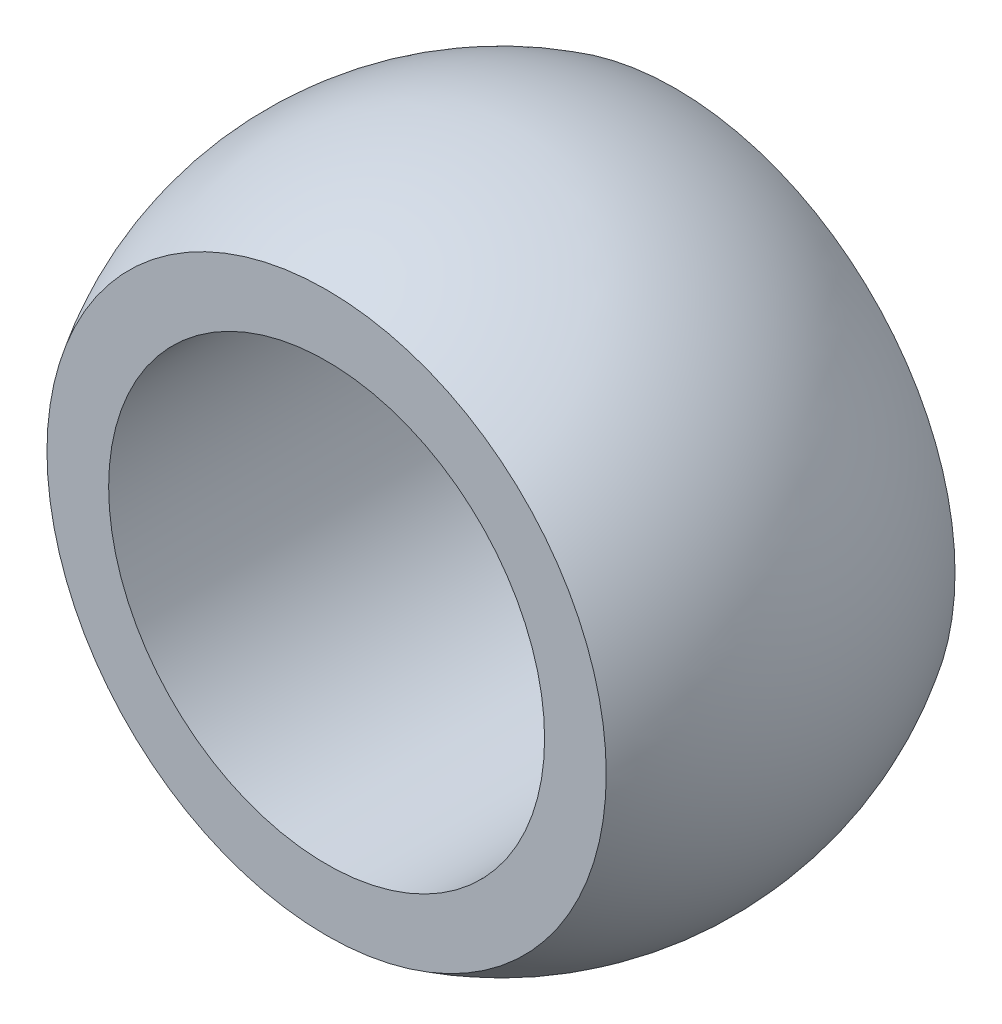
ISO-10303-21;
HEADER;
FILE_DESCRIPTION(('STEP AP214'),'2;1');
FILE_NAME('part.step','',(''),(''),'','','');
FILE_SCHEMA(('AUTOMOTIVE_DESIGN { 1 0 10303 214 1 1 1 1 }'));
ENDSEC;
DATA;
#1=APPLICATION_CONTEXT('core data for automotive mechanical design processes');
#2=APPLICATION_PROTOCOL_DEFINITION('international standard','automotive_design',2000,#1);
#3=PRODUCT_CONTEXT('',#1,'mechanical');
#4=PRODUCT('Part','Part','',(#3));
#5=PRODUCT_RELATED_PRODUCT_CATEGORY('part','',(#4));
#6=PRODUCT_DEFINITION_FORMATION('','',#4);
#7=PRODUCT_DEFINITION_CONTEXT('part definition',#1,'design');
#8=PRODUCT_DEFINITION('design','',#6,#7);
#9=PRODUCT_DEFINITION_SHAPE('','',#8);
#10=(LENGTH_UNIT() NAMED_UNIT(*) SI_UNIT(.MILLI.,.METRE.));
#11=(NAMED_UNIT(*) PLANE_ANGLE_UNIT() SI_UNIT($,.RADIAN.));
#12=(NAMED_UNIT(*) SI_UNIT($,.STERADIAN.) SOLID_ANGLE_UNIT());
#13=UNCERTAINTY_MEASURE_WITH_UNIT(LENGTH_MEASURE(1.E-05),#10,'distance_accuracy_value','');
#14=(GEOMETRIC_REPRESENTATION_CONTEXT(3) GLOBAL_UNCERTAINTY_ASSIGNED_CONTEXT((#13)) GLOBAL_UNIT_ASSIGNED_CONTEXT((#10,
#11,#12)) REPRESENTATION_CONTEXT('',''));
#15=CARTESIAN_POINT('',(0.,0.,0.));
#16=DIRECTION('',(0.,0.,1.));
#17=DIRECTION('',(1.,0.,0.));
#18=AXIS2_PLACEMENT_3D('',#15,#16,#17);
#19=CARTESIAN_POINT('',(0.,0.,0.));
#20=DIRECTION('',(0.,0.,-1.));
#21=DIRECTION('',(1.,0.,0.));
#22=AXIS2_PLACEMENT_3D('',#19,#20,#21);
#23=SPHERICAL_SURFACE('',#22,12.00023);
#24=CARTESIAN_POINT('',(0.,0.,-6.35));
#25=DIRECTION('',(0.,0.,1.));
#26=DIRECTION('',(0.,-1.,0.));
#27=AXIS2_PLACEMENT_3D('',#24,#25,#26);
#28=CIRCLE('',#27,10.1824859466095);
#29=CARTESIAN_POINT('',(0.,-10.1824859466095,-6.35));
#30=VERTEX_POINT('',#29);
#31=EDGE_CURVE('E10',#30,#30,#28,.T.);
#32=ORIENTED_EDGE('',*,*,#31,.T.);
#33=EDGE_LOOP('',(#32));
#34=FACE_BOUND('',#33,.T.);
#35=CARTESIAN_POINT('',(0.,0.,6.35));
#36=DIRECTION('',(0.,0.,1.));
#37=DIRECTION('',(1.,0.,0.));
#38=AXIS2_PLACEMENT_3D('',#35,#36,#37);
#39=CIRCLE('',#38,10.1824859466095);
#40=CARTESIAN_POINT('',(10.1824859466095,0.,6.35));
#41=VERTEX_POINT('',#40);
#42=EDGE_CURVE('E36',#41,#41,#39,.T.);
#43=ORIENTED_EDGE('',*,*,#42,.F.);
#44=EDGE_LOOP('',(#43));
#45=FACE_BOUND('',#44,.T.);
#46=ADVANCED_FACE('F30',(#34,#45),#23,.T.);
#47=CARTESIAN_POINT('',(-12.00023,0.,6.35));
#48=DIRECTION('',(0.,0.,1.));
#49=DIRECTION('',(1.,0.,0.));
#50=AXIS2_PLACEMENT_3D('',#47,#48,#49);
#51=PLANE('',#50);
#52=CARTESIAN_POINT('',(0.,0.,6.35));
#53=DIRECTION('',(0.,0.,1.));
#54=DIRECTION('',(1.,0.,0.));
#55=AXIS2_PLACEMENT_3D('',#52,#53,#54);
#56=CIRCLE('',#55,7.9375);
#57=CARTESIAN_POINT('',(7.9375,0.,6.35));
#58=VERTEX_POINT('',#57);
#59=EDGE_CURVE('E44',#58,#58,#56,.T.);
#60=ORIENTED_EDGE('',*,*,#59,.F.);
#61=EDGE_LOOP('',(#60));
#62=FACE_BOUND('',#61,.T.);
#63=ORIENTED_EDGE('',*,*,#42,.T.);
#64=EDGE_LOOP('',(#63));
#65=FACE_BOUND('',#64,.T.);
#66=ADVANCED_FACE('F52',(#62,#65),#51,.T.);
#67=CARTESIAN_POINT('',(-12.00023,0.,-6.35));
#68=DIRECTION('',(0.,0.,1.));
#69=DIRECTION('',(0.,-1.,0.));
#70=AXIS2_PLACEMENT_3D('',#67,#68,#69);
#71=PLANE('',#70);
#72=CARTESIAN_POINT('',(0.,0.,-6.35));
#73=DIRECTION('',(0.,0.,1.));
#74=DIRECTION('',(1.,0.,0.));
#75=AXIS2_PLACEMENT_3D('',#72,#73,#74);
#76=CIRCLE('',#75,7.9375);
#77=CARTESIAN_POINT('',(7.9375,0.,-6.35));
#78=VERTEX_POINT('',#77);
#79=EDGE_CURVE('E40',#78,#78,#76,.T.);
#80=ORIENTED_EDGE('',*,*,#79,.T.);
#81=EDGE_LOOP('',(#80));
#82=FACE_BOUND('',#81,.T.);
#83=ORIENTED_EDGE('',*,*,#31,.F.);
#84=EDGE_LOOP('',(#83));
#85=FACE_BOUND('',#84,.T.);
#86=ADVANCED_FACE('F54',(#82,#85),#71,.F.);
#87=CARTESIAN_POINT('',(0.,0.,-6.35));
#88=DIRECTION('',(0.,0.,1.));
#89=DIRECTION('',(1.,0.,0.));
#90=AXIS2_PLACEMENT_3D('',#87,#88,#89);
#91=CYLINDRICAL_SURFACE('',#90,7.9375);
#92=ORIENTED_EDGE('',*,*,#79,.F.);
#93=EDGE_LOOP('',(#92));
#94=FACE_BOUND('',#93,.T.);
#95=ORIENTED_EDGE('',*,*,#59,.T.);
#96=EDGE_LOOP('',(#95));
#97=FACE_BOUND('',#96,.T.);
#98=ADVANCED_FACE('F50',(#94,#97),#91,.F.);
#99=CLOSED_SHELL('',(#46,#66,#86,#98));
#100=MANIFOLD_SOLID_BREP('B2',#99);
#101=ADVANCED_BREP_SHAPE_REPRESENTATION('',(#18,#100),#14);
#102=SHAPE_DEFINITION_REPRESENTATION(#9,#101);
ENDSEC;
END-ISO-10303-21;
